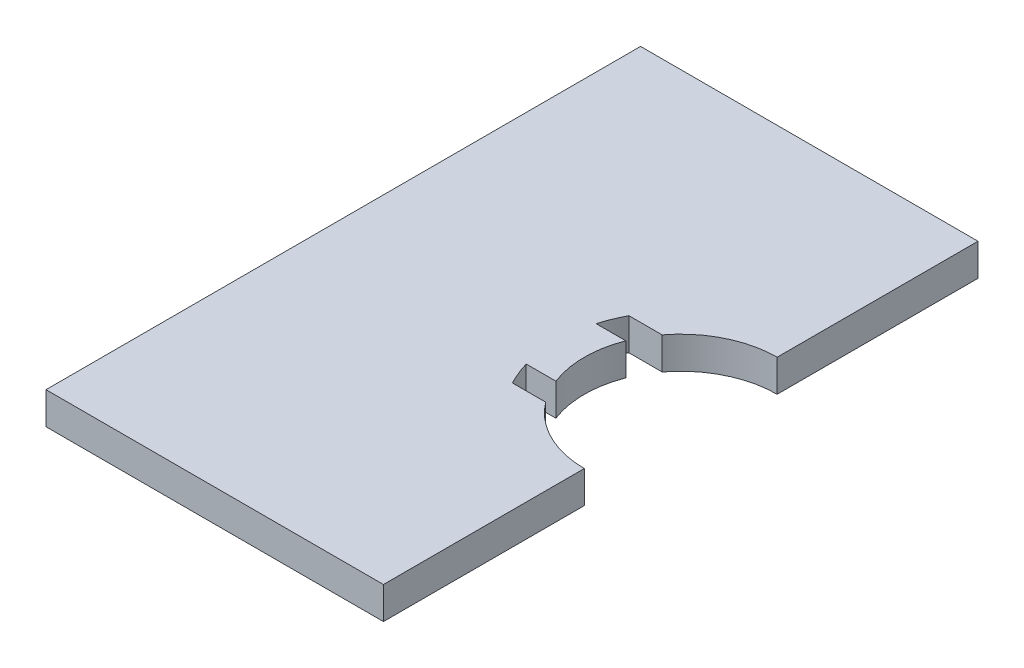
ISO-10303-21;
HEADER;
FILE_DESCRIPTION(('STEP AP214'),'2;1');
FILE_NAME('part.step','',(''),(''),'','','');
FILE_SCHEMA(('AUTOMOTIVE_DESIGN { 1 0 10303 214 1 1 1 1 }'));
ENDSEC;
DATA;
#1=APPLICATION_CONTEXT('core data for automotive mechanical design processes');
#2=APPLICATION_PROTOCOL_DEFINITION('international standard','automotive_design',2000,#1);
#3=PRODUCT_CONTEXT('',#1,'mechanical');
#4=PRODUCT('Part','Part','',(#3));
#5=PRODUCT_RELATED_PRODUCT_CATEGORY('part','',(#4));
#6=PRODUCT_DEFINITION_FORMATION('','',#4);
#7=PRODUCT_DEFINITION_CONTEXT('part definition',#1,'design');
#8=PRODUCT_DEFINITION('design','',#6,#7);
#9=PRODUCT_DEFINITION_SHAPE('','',#8);
#10=(LENGTH_UNIT() NAMED_UNIT(*) SI_UNIT(.MILLI.,.METRE.));
#11=(NAMED_UNIT(*) PLANE_ANGLE_UNIT() SI_UNIT($,.RADIAN.));
#12=(NAMED_UNIT(*) SI_UNIT($,.STERADIAN.) SOLID_ANGLE_UNIT());
#13=UNCERTAINTY_MEASURE_WITH_UNIT(LENGTH_MEASURE(1.E-05),#10,'distance_accuracy_value','');
#14=(GEOMETRIC_REPRESENTATION_CONTEXT(3) GLOBAL_UNCERTAINTY_ASSIGNED_CONTEXT((#13)) GLOBAL_UNIT_ASSIGNED_CONTEXT((#10,
#11,#12)) REPRESENTATION_CONTEXT('',''));
#15=CARTESIAN_POINT('',(0.,0.,0.));
#16=DIRECTION('',(0.,0.,1.));
#17=DIRECTION('',(1.,0.,0.));
#18=AXIS2_PLACEMENT_3D('',#15,#16,#17);
#19=CARTESIAN_POINT('',(0.,0.,0.));
#20=DIRECTION('',(1.,0.,0.));
#21=DIRECTION('',(0.,0.,-1.));
#22=AXIS2_PLACEMENT_3D('',#19,#20,#21);
#23=PLANE('',#22);
#24=DIRECTION('',(0.,0.,-1.));
#25=VECTOR('',#24,1.);
#26=CARTESIAN_POINT('',(0.,4.,0.));
#27=LINE('',#26,#25);
#28=CARTESIAN_POINT('',(0.,4.,37.));
#29=VERTEX_POINT('',#28);
#30=CARTESIAN_POINT('',(0.,4.,12.));
#31=VERTEX_POINT('',#30);
#32=EDGE_CURVE('E176',#29,#31,#27,.T.);
#33=ORIENTED_EDGE('',*,*,#32,.F.);
#34=DIRECTION('',(0.,-1.,0.));
#35=VECTOR('',#34,1.);
#36=CARTESIAN_POINT('',(0.,4.,37.));
#37=LINE('',#36,#35);
#38=CARTESIAN_POINT('',(0.,0.,37.));
#39=VERTEX_POINT('',#38);
#40=EDGE_CURVE('E189',#29,#39,#37,.T.);
#41=ORIENTED_EDGE('',*,*,#40,.T.);
#42=DIRECTION('',(0.,0.,-1.));
#43=VECTOR('',#42,1.);
#44=CARTESIAN_POINT('',(0.,0.,0.));
#45=LINE('',#44,#43);
#46=CARTESIAN_POINT('',(0.,0.,12.));
#47=VERTEX_POINT('',#46);
#48=EDGE_CURVE('E192',#39,#47,#45,.T.);
#49=ORIENTED_EDGE('',*,*,#48,.T.);
#50=DIRECTION('',(0.,-1.,0.));
#51=VECTOR('',#50,1.);
#52=CARTESIAN_POINT('',(0.,4.,12.));
#53=LINE('',#52,#51);
#54=EDGE_CURVE('E183',#31,#47,#53,.T.);
#55=ORIENTED_EDGE('',*,*,#54,.F.);
#56=EDGE_LOOP('',(#33,#41,#49,#55));
#57=FACE_BOUND('',#56,.T.);
#58=ADVANCED_FACE('F37',(#57),#23,.T.);
#59=CARTESIAN_POINT('',(0.,4.,-12.));
#60=VERTEX_POINT('',#59);
#61=CARTESIAN_POINT('',(0.,4.,-37.));
#62=VERTEX_POINT('',#61);
#63=EDGE_CURVE('E179',#60,#62,#27,.T.);
#64=ORIENTED_EDGE('',*,*,#63,.F.);
#65=DIRECTION('',(0.,-1.,0.));
#66=VECTOR('',#65,1.);
#67=CARTESIAN_POINT('',(0.,4.,-12.));
#68=LINE('',#67,#66);
#69=CARTESIAN_POINT('',(0.,0.,-12.));
#70=VERTEX_POINT('',#69);
#71=EDGE_CURVE('E180',#70,#60,#68,.F.);
#72=ORIENTED_EDGE('',*,*,#71,.F.);
#73=CARTESIAN_POINT('',(0.,0.,-37.));
#74=VERTEX_POINT('',#73);
#75=EDGE_CURVE('E193',#70,#74,#45,.T.);
#76=ORIENTED_EDGE('',*,*,#75,.T.);
#77=DIRECTION('',(0.,-1.,0.));
#78=VECTOR('',#77,1.);
#79=CARTESIAN_POINT('',(0.,4.,-37.));
#80=LINE('',#79,#78);
#81=EDGE_CURVE('E186',#62,#74,#80,.T.);
#82=ORIENTED_EDGE('',*,*,#81,.F.);
#83=EDGE_LOOP('',(#64,#72,#76,#82));
#84=FACE_BOUND('',#83,.T.);
#85=ADVANCED_FACE('F262',(#84),#23,.T.);
#86=CARTESIAN_POINT('',(0.,4.,37.));
#87=DIRECTION('',(0.,0.,-1.));
#88=DIRECTION('',(-1.,0.,0.));
#89=AXIS2_PLACEMENT_3D('',#86,#87,#88);
#90=PLANE('',#89);
#91=ORIENTED_EDGE('',*,*,#40,.F.);
#92=DIRECTION('',(1.,0.,0.));
#93=VECTOR('',#92,1.);
#94=CARTESIAN_POINT('',(0.,4.,37.));
#95=LINE('',#94,#93);
#96=CARTESIAN_POINT('',(-42.,4.,37.));
#97=VERTEX_POINT('',#96);
#98=EDGE_CURVE('E198',#97,#29,#95,.T.);
#99=ORIENTED_EDGE('',*,*,#98,.F.);
#100=DIRECTION('',(0.,-1.,0.));
#101=VECTOR('',#100,1.);
#102=CARTESIAN_POINT('',(-42.,4.,37.));
#103=LINE('',#102,#101);
#104=CARTESIAN_POINT('',(-42.,0.,37.));
#105=VERTEX_POINT('',#104);
#106=EDGE_CURVE('E99',#97,#105,#103,.T.);
#107=ORIENTED_EDGE('',*,*,#106,.T.);
#108=DIRECTION('',(1.,0.,0.));
#109=VECTOR('',#108,1.);
#110=CARTESIAN_POINT('',(0.,0.,37.));
#111=LINE('',#110,#109);
#112=EDGE_CURVE('E207',#105,#39,#111,.T.);
#113=ORIENTED_EDGE('',*,*,#112,.T.);
#114=EDGE_LOOP('',(#91,#99,#107,#113));
#115=FACE_BOUND('',#114,.T.);
#116=ADVANCED_FACE('F268',(#115),#90,.F.);
#117=CARTESIAN_POINT('',(0.,4.,-37.));
#118=DIRECTION('',(0.,0.,-1.));
#119=DIRECTION('',(-1.,0.,0.));
#120=AXIS2_PLACEMENT_3D('',#117,#118,#119);
#121=PLANE('',#120);
#122=DIRECTION('',(1.,0.,0.));
#123=VECTOR('',#122,1.);
#124=CARTESIAN_POINT('',(0.,4.,-37.));
#125=LINE('',#124,#123);
#126=CARTESIAN_POINT('',(-42.,4.,-37.));
#127=VERTEX_POINT('',#126);
#128=EDGE_CURVE('E155',#127,#62,#125,.T.);
#129=ORIENTED_EDGE('',*,*,#128,.T.);
#130=ORIENTED_EDGE('',*,*,#81,.T.);
#131=DIRECTION('',(1.,0.,0.));
#132=VECTOR('',#131,1.);
#133=CARTESIAN_POINT('',(0.,0.,-37.));
#134=LINE('',#133,#132);
#135=CARTESIAN_POINT('',(-42.,0.,-37.));
#136=VERTEX_POINT('',#135);
#137=EDGE_CURVE('E204',#136,#74,#134,.T.);
#138=ORIENTED_EDGE('',*,*,#137,.F.);
#139=DIRECTION('',(0.,-1.,0.));
#140=VECTOR('',#139,1.);
#141=CARTESIAN_POINT('',(-42.,4.,-37.));
#142=LINE('',#141,#140);
#143=EDGE_CURVE('E243',#127,#136,#142,.T.);
#144=ORIENTED_EDGE('',*,*,#143,.F.);
#145=EDGE_LOOP('',(#129,#130,#138,#144));
#146=FACE_BOUND('',#145,.T.);
#147=ADVANCED_FACE('F264',(#146),#121,.T.);
#148=CARTESIAN_POINT('',(0.,4.,0.));
#149=DIRECTION('',(0.,-1.,0.));
#150=DIRECTION('',(0.,0.,-1.));
#151=AXIS2_PLACEMENT_3D('',#148,#149,#150);
#152=CYLINDRICAL_SURFACE('',#151,12.);
#153=CARTESIAN_POINT('',(0.,4.,0.));
#154=DIRECTION('',(0.,1.,0.));
#155=DIRECTION('',(0.,0.,1.));
#156=AXIS2_PLACEMENT_3D('',#153,#154,#155);
#157=CIRCLE('',#156,12.);
#158=CARTESIAN_POINT('',(-9.56229574945264,4.,7.25));
#159=VERTEX_POINT('',#158);
#160=EDGE_CURVE('E175',#159,#31,#157,.T.);
#161=ORIENTED_EDGE('',*,*,#160,.T.);
#162=ORIENTED_EDGE('',*,*,#54,.T.);
#163=CARTESIAN_POINT('',(0.,0.,0.));
#164=DIRECTION('',(0.,1.,0.));
#165=DIRECTION('',(0.,0.,1.));
#166=AXIS2_PLACEMENT_3D('',#163,#164,#165);
#167=CIRCLE('',#166,12.);
#168=CARTESIAN_POINT('',(-9.56229574945264,0.,7.25));
#169=VERTEX_POINT('',#168);
#170=EDGE_CURVE('E11',#169,#47,#167,.T.);
#171=ORIENTED_EDGE('',*,*,#170,.F.);
#172=DIRECTION('',(0.,-1.,0.));
#173=VECTOR('',#172,1.);
#174=CARTESIAN_POINT('',(-9.56229574945264,4.,7.25));
#175=LINE('',#174,#173);
#176=EDGE_CURVE('E54',#159,#169,#175,.T.);
#177=ORIENTED_EDGE('',*,*,#176,.F.);
#178=EDGE_LOOP('',(#161,#162,#171,#177));
#179=FACE_BOUND('',#178,.T.);
#180=ADVANCED_FACE('F301',(#179),#152,.F.);
#181=CARTESIAN_POINT('',(0.,4.,0.));
#182=DIRECTION('',(0.,-1.,0.));
#183=DIRECTION('',(0.,0.,-1.));
#184=AXIS2_PLACEMENT_3D('',#181,#182,#183);
#185=CYLINDRICAL_SURFACE('',#184,12.);
#186=CARTESIAN_POINT('',(0.,0.,0.));
#187=DIRECTION('',(0.,1.,0.));
#188=DIRECTION('',(0.,0.,1.));
#189=AXIS2_PLACEMENT_3D('',#186,#187,#188);
#190=CIRCLE('',#189,12.);
#191=CARTESIAN_POINT('',(-9.56229574945264,0.,-7.25));
#192=VERTEX_POINT('',#191);
#193=EDGE_CURVE('E208',#70,#192,#190,.T.);
#194=ORIENTED_EDGE('',*,*,#193,.F.);
#195=ORIENTED_EDGE('',*,*,#71,.T.);
#196=CARTESIAN_POINT('',(0.,4.,0.));
#197=DIRECTION('',(0.,1.,0.));
#198=DIRECTION('',(0.,0.,1.));
#199=AXIS2_PLACEMENT_3D('',#196,#197,#198);
#200=CIRCLE('',#199,12.);
#201=CARTESIAN_POINT('',(-9.56229574945264,4.,-7.25));
#202=VERTEX_POINT('',#201);
#203=EDGE_CURVE('E161',#60,#202,#200,.T.);
#204=ORIENTED_EDGE('',*,*,#203,.T.);
#205=DIRECTION('',(0.,-1.,0.));
#206=VECTOR('',#205,1.);
#207=CARTESIAN_POINT('',(-9.56229574945264,4.,-7.25));
#208=LINE('',#207,#206);
#209=EDGE_CURVE('E156',#202,#192,#208,.T.);
#210=ORIENTED_EDGE('',*,*,#209,.T.);
#211=EDGE_LOOP('',(#194,#195,#204,#210));
#212=FACE_BOUND('',#211,.T.);
#213=ADVANCED_FACE('F281',(#212),#185,.F.);
#214=CARTESIAN_POINT('',(0.,4.,0.));
#215=DIRECTION('',(0.,1.,0.));
#216=DIRECTION('',(0.,0.,1.));
#217=AXIS2_PLACEMENT_3D('',#214,#215,#216);
#218=PLANE('',#217);
#219=ORIENTED_EDGE('',*,*,#98,.T.);
#220=ORIENTED_EDGE('',*,*,#32,.T.);
#221=ORIENTED_EDGE('',*,*,#160,.F.);
#222=DIRECTION('',(1.,0.,0.));
#223=VECTOR('',#222,1.);
#224=CARTESIAN_POINT('',(0.,4.,7.24999999999999));
#225=LINE('',#224,#223);
#226=CARTESIAN_POINT('',(-13.6999087588203,4.,7.25));
#227=VERTEX_POINT('',#226);
#228=EDGE_CURVE('E173',#227,#159,#225,.T.);
#229=ORIENTED_EDGE('',*,*,#228,.F.);
#230=CARTESIAN_POINT('',(0.,4.,0.));
#231=DIRECTION('',(0.,1.,0.));
#232=DIRECTION('',(0.,0.,1.));
#233=AXIS2_PLACEMENT_3D('',#230,#231,#232);
#234=CIRCLE('',#233,15.5);
#235=CARTESIAN_POINT('',(-14.8770796865514,4.,4.35));
#236=VERTEX_POINT('',#235);
#237=EDGE_CURVE('E171',#236,#227,#234,.T.);
#238=ORIENTED_EDGE('',*,*,#237,.F.);
#239=DIRECTION('',(1.,0.,0.));
#240=VECTOR('',#239,1.);
#241=CARTESIAN_POINT('',(0.,4.,4.34999999999999));
#242=LINE('',#241,#240);
#243=CARTESIAN_POINT('',(-11.1838052558152,4.,4.35));
#244=VERTEX_POINT('',#243);
#245=EDGE_CURVE('E130',#236,#244,#242,.T.);
#246=ORIENTED_EDGE('',*,*,#245,.T.);
#247=CARTESIAN_POINT('',(0.,4.,0.));
#248=DIRECTION('',(0.,1.,0.));
#249=DIRECTION('',(0.,0.,1.));
#250=AXIS2_PLACEMENT_3D('',#247,#248,#249);
#251=CIRCLE('',#250,12.);
#252=CARTESIAN_POINT('',(-11.1838052558152,4.,-4.35));
#253=VERTEX_POINT('',#252);
#254=EDGE_CURVE('E167',#253,#244,#251,.T.);
#255=ORIENTED_EDGE('',*,*,#254,.F.);
#256=DIRECTION('',(1.,0.,0.));
#257=VECTOR('',#256,1.);
#258=CARTESIAN_POINT('',(0.,4.,-4.35));
#259=LINE('',#258,#257);
#260=CARTESIAN_POINT('',(-14.8770796865514,4.,-4.35));
#261=VERTEX_POINT('',#260);
#262=EDGE_CURVE('E164',#261,#253,#259,.T.);
#263=ORIENTED_EDGE('',*,*,#262,.F.);
#264=CARTESIAN_POINT('',(0.,4.,0.));
#265=DIRECTION('',(0.,1.,0.));
#266=DIRECTION('',(0.,0.,1.));
#267=AXIS2_PLACEMENT_3D('',#264,#265,#266);
#268=CIRCLE('',#267,15.5);
#269=CARTESIAN_POINT('',(-13.6999087588203,4.,-7.25));
#270=VERTEX_POINT('',#269);
#271=EDGE_CURVE('E160',#270,#261,#268,.T.);
#272=ORIENTED_EDGE('',*,*,#271,.F.);
#273=DIRECTION('',(1.,0.,0.));
#274=VECTOR('',#273,1.);
#275=CARTESIAN_POINT('',(0.,4.,-7.25000000000001));
#276=LINE('',#275,#274);
#277=EDGE_CURVE('E157',#270,#202,#276,.T.);
#278=ORIENTED_EDGE('',*,*,#277,.T.);
#279=ORIENTED_EDGE('',*,*,#203,.F.);
#280=ORIENTED_EDGE('',*,*,#63,.T.);
#281=ORIENTED_EDGE('',*,*,#128,.F.);
#282=DIRECTION('',(0.,0.,-1.));
#283=VECTOR('',#282,1.);
#284=CARTESIAN_POINT('',(-42.,4.,0.));
#285=LINE('',#284,#283);
#286=EDGE_CURVE('E152',#97,#127,#285,.T.);
#287=ORIENTED_EDGE('',*,*,#286,.F.);
#288=EDGE_LOOP('',(#219,#220,#221,#229,#238,#246,#255,#263,#272,#278,#279,#280,#281,#287));
#289=FACE_BOUND('',#288,.T.);
#290=ADVANCED_FACE('F39',(#289),#218,.T.);
#291=CARTESIAN_POINT('',(0.,0.,0.));
#292=DIRECTION('',(0.,1.,0.));
#293=DIRECTION('',(0.,0.,1.));
#294=AXIS2_PLACEMENT_3D('',#291,#292,#293);
#295=PLANE('',#294);
#296=ORIENTED_EDGE('',*,*,#48,.F.);
#297=ORIENTED_EDGE('',*,*,#112,.F.);
#298=DIRECTION('',(0.,0.,-1.));
#299=VECTOR('',#298,1.);
#300=CARTESIAN_POINT('',(-42.,0.,0.));
#301=LINE('',#300,#299);
#302=EDGE_CURVE('E203',#105,#136,#301,.T.);
#303=ORIENTED_EDGE('',*,*,#302,.T.);
#304=ORIENTED_EDGE('',*,*,#137,.T.);
#305=ORIENTED_EDGE('',*,*,#75,.F.);
#306=ORIENTED_EDGE('',*,*,#193,.T.);
#307=DIRECTION('',(1.,0.,0.));
#308=VECTOR('',#307,1.);
#309=CARTESIAN_POINT('',(0.,0.,-7.25000000000001));
#310=LINE('',#309,#308);
#311=CARTESIAN_POINT('',(-13.6999087588203,0.,-7.25));
#312=VERTEX_POINT('',#311);
#313=EDGE_CURVE('E209',#312,#192,#310,.T.);
#314=ORIENTED_EDGE('',*,*,#313,.F.);
#315=CARTESIAN_POINT('',(0.,0.,0.));
#316=DIRECTION('',(0.,1.,0.));
#317=DIRECTION('',(0.,0.,1.));
#318=AXIS2_PLACEMENT_3D('',#315,#316,#317);
#319=CIRCLE('',#318,15.5);
#320=CARTESIAN_POINT('',(-14.8770796865514,0.,-4.35));
#321=VERTEX_POINT('',#320);
#322=EDGE_CURVE('E215',#312,#321,#319,.T.);
#323=ORIENTED_EDGE('',*,*,#322,.T.);
#324=DIRECTION('',(1.,0.,0.));
#325=VECTOR('',#324,1.);
#326=CARTESIAN_POINT('',(0.,0.,-4.35));
#327=LINE('',#326,#325);
#328=CARTESIAN_POINT('',(-11.1838052558152,0.,-4.35));
#329=VERTEX_POINT('',#328);
#330=EDGE_CURVE('E220',#321,#329,#327,.T.);
#331=ORIENTED_EDGE('',*,*,#330,.T.);
#332=CARTESIAN_POINT('',(0.,0.,0.));
#333=DIRECTION('',(0.,1.,0.));
#334=DIRECTION('',(0.,0.,1.));
#335=AXIS2_PLACEMENT_3D('',#332,#333,#334);
#336=CIRCLE('',#335,12.);
#337=CARTESIAN_POINT('',(-11.1838052558152,0.,4.35));
#338=VERTEX_POINT('',#337);
#339=EDGE_CURVE('E145',#329,#338,#336,.T.);
#340=ORIENTED_EDGE('',*,*,#339,.T.);
#341=DIRECTION('',(1.,0.,0.));
#342=VECTOR('',#341,1.);
#343=CARTESIAN_POINT('',(0.,0.,4.34999999999999));
#344=LINE('',#343,#342);
#345=CARTESIAN_POINT('',(-14.8770796865514,0.,4.35));
#346=VERTEX_POINT('',#345);
#347=EDGE_CURVE('E128',#346,#338,#344,.T.);
#348=ORIENTED_EDGE('',*,*,#347,.F.);
#349=CARTESIAN_POINT('',(0.,0.,0.));
#350=DIRECTION('',(0.,1.,0.));
#351=DIRECTION('',(0.,0.,1.));
#352=AXIS2_PLACEMENT_3D('',#349,#350,#351);
#353=CIRCLE('',#352,15.5);
#354=CARTESIAN_POINT('',(-13.6999087588203,0.,7.25));
#355=VERTEX_POINT('',#354);
#356=EDGE_CURVE('E142',#346,#355,#353,.T.);
#357=ORIENTED_EDGE('',*,*,#356,.T.);
#358=DIRECTION('',(1.,0.,0.));
#359=VECTOR('',#358,1.);
#360=CARTESIAN_POINT('',(0.,0.,7.24999999999999));
#361=LINE('',#360,#359);
#362=EDGE_CURVE('E46',#355,#169,#361,.T.);
#363=ORIENTED_EDGE('',*,*,#362,.T.);
#364=ORIENTED_EDGE('',*,*,#170,.T.);
#365=EDGE_LOOP('',(#296,#297,#303,#304,#305,#306,#314,#323,#331,#340,#348,#357,#363,#364));
#366=FACE_BOUND('',#365,.T.);
#367=ADVANCED_FACE('F140',(#366),#295,.F.);
#368=CARTESIAN_POINT('',(0.,4.,7.24999999999999));
#369=DIRECTION('',(0.,0.,-1.));
#370=DIRECTION('',(-1.,0.,0.));
#371=AXIS2_PLACEMENT_3D('',#368,#369,#370);
#372=PLANE('',#371);
#373=ORIENTED_EDGE('',*,*,#362,.F.);
#374=DIRECTION('',(0.,-1.,0.));
#375=VECTOR('',#374,1.);
#376=CARTESIAN_POINT('',(-13.6999087588203,4.,7.25));
#377=LINE('',#376,#375);
#378=EDGE_CURVE('E87',#227,#355,#377,.T.);
#379=ORIENTED_EDGE('',*,*,#378,.F.);
#380=ORIENTED_EDGE('',*,*,#228,.T.);
#381=ORIENTED_EDGE('',*,*,#176,.T.);
#382=EDGE_LOOP('',(#373,#379,#380,#381));
#383=FACE_BOUND('',#382,.T.);
#384=ADVANCED_FACE('F307',(#383),#372,.T.);
#385=CARTESIAN_POINT('',(0.,4.,0.));
#386=DIRECTION('',(0.,-1.,0.));
#387=DIRECTION('',(0.,0.,-1.));
#388=AXIS2_PLACEMENT_3D('',#385,#386,#387);
#389=CYLINDRICAL_SURFACE('',#388,15.5);
#390=ORIENTED_EDGE('',*,*,#356,.F.);
#391=DIRECTION('',(0.,-1.,0.));
#392=VECTOR('',#391,1.);
#393=CARTESIAN_POINT('',(-14.8770796865514,4.,4.35));
#394=LINE('',#393,#392);
#395=EDGE_CURVE('E124',#236,#346,#394,.T.);
#396=ORIENTED_EDGE('',*,*,#395,.F.);
#397=ORIENTED_EDGE('',*,*,#237,.T.);
#398=ORIENTED_EDGE('',*,*,#378,.T.);
#399=EDGE_LOOP('',(#390,#396,#397,#398));
#400=FACE_BOUND('',#399,.T.);
#401=ADVANCED_FACE('F147',(#400),#389,.F.);
#402=CARTESIAN_POINT('',(0.,4.,4.34999999999999));
#403=DIRECTION('',(0.,0.,-1.));
#404=DIRECTION('',(-1.,0.,0.));
#405=AXIS2_PLACEMENT_3D('',#402,#403,#404);
#406=PLANE('',#405);
#407=ORIENTED_EDGE('',*,*,#347,.T.);
#408=DIRECTION('',(0.,-1.,0.));
#409=VECTOR('',#408,1.);
#410=CARTESIAN_POINT('',(-11.1838052558152,4.,4.35));
#411=LINE('',#410,#409);
#412=EDGE_CURVE('E135',#244,#338,#411,.T.);
#413=ORIENTED_EDGE('',*,*,#412,.F.);
#414=ORIENTED_EDGE('',*,*,#245,.F.);
#415=ORIENTED_EDGE('',*,*,#395,.T.);
#416=EDGE_LOOP('',(#407,#413,#414,#415));
#417=FACE_BOUND('',#416,.T.);
#418=ADVANCED_FACE('F126',(#417),#406,.F.);
#419=CARTESIAN_POINT('',(0.,4.,0.));
#420=DIRECTION('',(0.,-1.,0.));
#421=DIRECTION('',(0.,0.,-1.));
#422=AXIS2_PLACEMENT_3D('',#419,#420,#421);
#423=CYLINDRICAL_SURFACE('',#422,12.);
#424=ORIENTED_EDGE('',*,*,#339,.F.);
#425=DIRECTION('',(0.,-1.,0.));
#426=VECTOR('',#425,1.);
#427=CARTESIAN_POINT('',(-11.1838052558152,4.,-4.35));
#428=LINE('',#427,#426);
#429=EDGE_CURVE('E231',#253,#329,#428,.T.);
#430=ORIENTED_EDGE('',*,*,#429,.F.);
#431=ORIENTED_EDGE('',*,*,#254,.T.);
#432=ORIENTED_EDGE('',*,*,#412,.T.);
#433=EDGE_LOOP('',(#424,#430,#431,#432));
#434=FACE_BOUND('',#433,.T.);
#435=ADVANCED_FACE('F235',(#434),#423,.F.);
#436=CARTESIAN_POINT('',(0.,4.,-4.35));
#437=DIRECTION('',(0.,0.,-1.));
#438=DIRECTION('',(-1.,0.,0.));
#439=AXIS2_PLACEMENT_3D('',#436,#437,#438);
#440=PLANE('',#439);
#441=ORIENTED_EDGE('',*,*,#330,.F.);
#442=DIRECTION('',(0.,-1.,0.));
#443=VECTOR('',#442,1.);
#444=CARTESIAN_POINT('',(-14.8770796865514,4.,-4.35));
#445=LINE('',#444,#443);
#446=EDGE_CURVE('E229',#261,#321,#445,.T.);
#447=ORIENTED_EDGE('',*,*,#446,.F.);
#448=ORIENTED_EDGE('',*,*,#262,.T.);
#449=ORIENTED_EDGE('',*,*,#429,.T.);
#450=EDGE_LOOP('',(#441,#447,#448,#449));
#451=FACE_BOUND('',#450,.T.);
#452=ADVANCED_FACE('F228',(#451),#440,.T.);
#453=CARTESIAN_POINT('',(0.,4.,0.));
#454=DIRECTION('',(0.,-1.,0.));
#455=DIRECTION('',(0.,0.,-1.));
#456=AXIS2_PLACEMENT_3D('',#453,#454,#455);
#457=CYLINDRICAL_SURFACE('',#456,15.5);
#458=ORIENTED_EDGE('',*,*,#322,.F.);
#459=DIRECTION('',(0.,-1.,0.));
#460=VECTOR('',#459,1.);
#461=CARTESIAN_POINT('',(-13.6999087588203,4.,-7.25));
#462=LINE('',#461,#460);
#463=EDGE_CURVE('E240',#270,#312,#462,.T.);
#464=ORIENTED_EDGE('',*,*,#463,.F.);
#465=ORIENTED_EDGE('',*,*,#271,.T.);
#466=ORIENTED_EDGE('',*,*,#446,.T.);
#467=EDGE_LOOP('',(#458,#464,#465,#466));
#468=FACE_BOUND('',#467,.T.);
#469=ADVANCED_FACE('F286',(#468),#457,.F.);
#470=CARTESIAN_POINT('',(0.,4.,-7.25000000000001));
#471=DIRECTION('',(0.,0.,-1.));
#472=DIRECTION('',(-1.,0.,0.));
#473=AXIS2_PLACEMENT_3D('',#470,#471,#472);
#474=PLANE('',#473);
#475=ORIENTED_EDGE('',*,*,#313,.T.);
#476=ORIENTED_EDGE('',*,*,#209,.F.);
#477=ORIENTED_EDGE('',*,*,#277,.F.);
#478=ORIENTED_EDGE('',*,*,#463,.T.);
#479=EDGE_LOOP('',(#475,#476,#477,#478));
#480=FACE_BOUND('',#479,.T.);
#481=ADVANCED_FACE('F283',(#480),#474,.F.);
#482=CARTESIAN_POINT('',(-42.,4.,0.));
#483=DIRECTION('',(-1.,0.,0.));
#484=DIRECTION('',(0.,0.,1.));
#485=AXIS2_PLACEMENT_3D('',#482,#483,#484);
#486=PLANE('',#485);
#487=ORIENTED_EDGE('',*,*,#302,.F.);
#488=ORIENTED_EDGE('',*,*,#106,.F.);
#489=ORIENTED_EDGE('',*,*,#286,.T.);
#490=ORIENTED_EDGE('',*,*,#143,.T.);
#491=EDGE_LOOP('',(#487,#488,#489,#490));
#492=FACE_BOUND('',#491,.T.);
#493=ADVANCED_FACE('F266',(#492),#486,.T.);
#494=CLOSED_SHELL('',(#58,#85,#116,#147,#180,#213,#290,#367,#384,#401,#418,#435,#452,#469,#481,#493));
#495=MANIFOLD_SOLID_BREP('B2',#494);
#496=ADVANCED_BREP_SHAPE_REPRESENTATION('',(#18,#495),#14);
#497=SHAPE_DEFINITION_REPRESENTATION(#9,#496);
ENDSEC;
END-ISO-10303-21;
